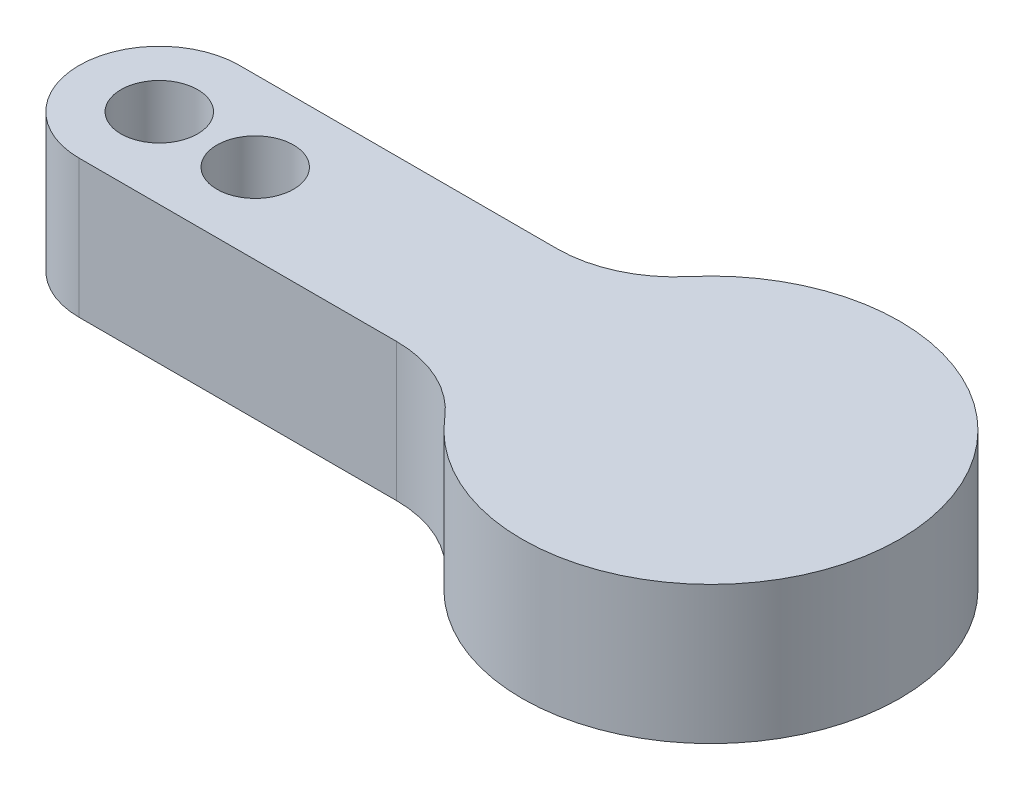
ISO-10303-21;
HEADER;
FILE_DESCRIPTION(('STEP AP214'),'2;1');
FILE_NAME('part.step','',(''),(''),'','','');
FILE_SCHEMA(('AUTOMOTIVE_DESIGN { 1 0 10303 214 1 1 1 1 }'));
ENDSEC;
DATA;
#1=APPLICATION_CONTEXT('core data for automotive mechanical design processes');
#2=APPLICATION_PROTOCOL_DEFINITION('international standard','automotive_design',2000,#1);
#3=PRODUCT_CONTEXT('',#1,'mechanical');
#4=PRODUCT('Part','Part','',(#3));
#5=PRODUCT_RELATED_PRODUCT_CATEGORY('part','',(#4));
#6=PRODUCT_DEFINITION_FORMATION('','',#4);
#7=PRODUCT_DEFINITION_CONTEXT('part definition',#1,'design');
#8=PRODUCT_DEFINITION('design','',#6,#7);
#9=PRODUCT_DEFINITION_SHAPE('','',#8);
#10=(LENGTH_UNIT() NAMED_UNIT(*) SI_UNIT(.MILLI.,.METRE.));
#11=(NAMED_UNIT(*) PLANE_ANGLE_UNIT() SI_UNIT($,.RADIAN.));
#12=(NAMED_UNIT(*) SI_UNIT($,.STERADIAN.) SOLID_ANGLE_UNIT());
#13=UNCERTAINTY_MEASURE_WITH_UNIT(LENGTH_MEASURE(1.E-05),#10,'distance_accuracy_value','');
#14=(GEOMETRIC_REPRESENTATION_CONTEXT(3) GLOBAL_UNCERTAINTY_ASSIGNED_CONTEXT((#13)) GLOBAL_UNIT_ASSIGNED_CONTEXT((#10,
#11,#12)) REPRESENTATION_CONTEXT('',''));
#15=CARTESIAN_POINT('',(0.,0.,0.));
#16=DIRECTION('',(0.,0.,1.));
#17=DIRECTION('',(1.,0.,0.));
#18=AXIS2_PLACEMENT_3D('',#15,#16,#17);
#19=CARTESIAN_POINT('',(-9.92169340384997,5.842,-8.4));
#20=DIRECTION('',(0.,-1.,0.));
#21=DIRECTION('',(0.,0.,-1.));
#22=AXIS2_PLACEMENT_3D('',#19,#20,#21);
#23=CYLINDRICAL_SURFACE('',#22,5.);
#24=CARTESIAN_POINT('',(-9.92169340384997,0.,-8.4));
#25=DIRECTION('',(0.,1.,0.));
#26=DIRECTION('',(0.,0.,1.));
#27=AXIS2_PLACEMENT_3D('',#24,#25,#26);
#28=CIRCLE('',#27,5.);
#29=CARTESIAN_POINT('',(-9.92169340384997,0.,-3.4));
#30=VERTEX_POINT('',#29);
#31=CARTESIAN_POINT('',(-6.10565747929229,0.,-5.16923076923077));
#32=VERTEX_POINT('',#31);
#33=EDGE_CURVE('E127',#30,#32,#28,.T.);
#34=ORIENTED_EDGE('',*,*,#33,.F.);
#35=DIRECTION('',(0.,-1.,0.));
#36=VECTOR('',#35,1.);
#37=CARTESIAN_POINT('',(-9.92169340384997,5.842,-3.4));
#38=LINE('',#37,#36);
#39=CARTESIAN_POINT('',(-9.92169340384997,5.842,-3.4));
#40=VERTEX_POINT('',#39);
#41=EDGE_CURVE('E11',#40,#30,#38,.T.);
#42=ORIENTED_EDGE('',*,*,#41,.F.);
#43=CARTESIAN_POINT('',(-9.92169340384997,5.842,-8.4));
#44=DIRECTION('',(0.,1.,0.));
#45=DIRECTION('',(0.,0.,1.));
#46=AXIS2_PLACEMENT_3D('',#43,#44,#45);
#47=CIRCLE('',#46,5.);
#48=CARTESIAN_POINT('',(-6.10565747929229,5.842,-5.16923076923077));
#49=VERTEX_POINT('',#48);
#50=EDGE_CURVE('E145',#40,#49,#47,.T.);
#51=ORIENTED_EDGE('',*,*,#50,.T.);
#52=DIRECTION('',(0.,-1.,0.));
#53=VECTOR('',#52,1.);
#54=CARTESIAN_POINT('',(-6.10565747929229,5.842,-5.16923076923077));
#55=LINE('',#54,#53);
#56=EDGE_CURVE('E84',#49,#32,#55,.T.);
#57=ORIENTED_EDGE('',*,*,#56,.T.);
#58=EDGE_LOOP('',(#34,#42,#51,#57));
#59=FACE_BOUND('',#58,.T.);
#60=ADVANCED_FACE('F39',(#59),#23,.F.);
#61=CARTESIAN_POINT('',(0.,5.842,-3.4));
#62=DIRECTION('',(0.,0.,-1.));
#63=DIRECTION('',(-1.,0.,0.));
#64=AXIS2_PLACEMENT_3D('',#61,#62,#63);
#65=PLANE('',#64);
#66=DIRECTION('',(1.,0.,0.));
#67=VECTOR('',#66,1.);
#68=CARTESIAN_POINT('',(0.,0.,-3.4));
#69=LINE('',#68,#67);
#70=CARTESIAN_POINT('',(-23.368,0.,-3.4));
#71=VERTEX_POINT('',#70);
#72=EDGE_CURVE('E130',#71,#30,#69,.T.);
#73=ORIENTED_EDGE('',*,*,#72,.F.);
#74=DIRECTION('',(0.,-1.,0.));
#75=VECTOR('',#74,1.);
#76=CARTESIAN_POINT('',(-23.368,5.842,-3.4));
#77=LINE('',#76,#75);
#78=CARTESIAN_POINT('',(-23.368,5.842,-3.4));
#79=VERTEX_POINT('',#78);
#80=EDGE_CURVE('E47',#79,#71,#77,.T.);
#81=ORIENTED_EDGE('',*,*,#80,.F.);
#82=DIRECTION('',(1.,0.,0.));
#83=VECTOR('',#82,1.);
#84=CARTESIAN_POINT('',(0.,5.842,-3.4));
#85=LINE('',#84,#83);
#86=EDGE_CURVE('E158',#79,#40,#85,.T.);
#87=ORIENTED_EDGE('',*,*,#86,.T.);
#88=ORIENTED_EDGE('',*,*,#41,.T.);
#89=EDGE_LOOP('',(#73,#81,#87,#88));
#90=FACE_BOUND('',#89,.T.);
#91=ADVANCED_FACE('F157',(#90),#65,.T.);
#92=CARTESIAN_POINT('',(-23.368,5.842,0.));
#93=DIRECTION('',(0.,-1.,0.));
#94=DIRECTION('',(0.,0.,-1.));
#95=AXIS2_PLACEMENT_3D('',#92,#93,#94);
#96=CYLINDRICAL_SURFACE('',#95,3.4);
#97=CARTESIAN_POINT('',(-23.368,0.,0.));
#98=DIRECTION('',(0.,1.,0.));
#99=DIRECTION('',(0.,0.,1.));
#100=AXIS2_PLACEMENT_3D('',#97,#98,#99);
#101=CIRCLE('',#100,3.4);
#102=CARTESIAN_POINT('',(-23.368,0.,3.4));
#103=VERTEX_POINT('',#102);
#104=EDGE_CURVE('E133',#71,#103,#101,.T.);
#105=ORIENTED_EDGE('',*,*,#104,.T.);
#106=DIRECTION('',(0.,-1.,0.));
#107=VECTOR('',#106,1.);
#108=CARTESIAN_POINT('',(-23.368,5.842,3.4));
#109=LINE('',#108,#107);
#110=CARTESIAN_POINT('',(-23.368,5.842,3.4));
#111=VERTEX_POINT('',#110);
#112=EDGE_CURVE('E113',#111,#103,#109,.T.);
#113=ORIENTED_EDGE('',*,*,#112,.F.);
#114=CARTESIAN_POINT('',(-23.368,5.842,0.));
#115=DIRECTION('',(0.,1.,0.));
#116=DIRECTION('',(0.,0.,1.));
#117=AXIS2_PLACEMENT_3D('',#114,#115,#116);
#118=CIRCLE('',#117,3.4);
#119=EDGE_CURVE('E104',#79,#111,#118,.T.);
#120=ORIENTED_EDGE('',*,*,#119,.F.);
#121=ORIENTED_EDGE('',*,*,#80,.T.);
#122=EDGE_LOOP('',(#105,#113,#120,#121));
#123=FACE_BOUND('',#122,.T.);
#124=ADVANCED_FACE('F150',(#123),#96,.T.);
#125=CARTESIAN_POINT('',(0.,5.842,3.4));
#126=DIRECTION('',(0.,0.,-1.));
#127=DIRECTION('',(-1.,0.,0.));
#128=AXIS2_PLACEMENT_3D('',#125,#126,#127);
#129=PLANE('',#128);
#130=DIRECTION('',(1.,0.,0.));
#131=VECTOR('',#130,1.);
#132=CARTESIAN_POINT('',(0.,0.,3.4));
#133=LINE('',#132,#131);
#134=CARTESIAN_POINT('',(-9.92169340384997,0.,3.4));
#135=VERTEX_POINT('',#134);
#136=EDGE_CURVE('E112',#103,#135,#133,.T.);
#137=ORIENTED_EDGE('',*,*,#136,.T.);
#138=DIRECTION('',(0.,-1.,0.));
#139=VECTOR('',#138,1.);
#140=CARTESIAN_POINT('',(-9.92169340384997,5.842,3.4));
#141=LINE('',#140,#139);
#142=CARTESIAN_POINT('',(-9.92169340384997,5.842,3.4));
#143=VERTEX_POINT('',#142);
#144=EDGE_CURVE('E109',#143,#135,#141,.T.);
#145=ORIENTED_EDGE('',*,*,#144,.F.);
#146=DIRECTION('',(1.,0.,0.));
#147=VECTOR('',#146,1.);
#148=CARTESIAN_POINT('',(0.,5.842,3.4));
#149=LINE('',#148,#147);
#150=EDGE_CURVE('E96',#111,#143,#149,.T.);
#151=ORIENTED_EDGE('',*,*,#150,.F.);
#152=ORIENTED_EDGE('',*,*,#112,.T.);
#153=EDGE_LOOP('',(#137,#145,#151,#152));
#154=FACE_BOUND('',#153,.T.);
#155=ADVANCED_FACE('F110',(#154),#129,.F.);
#156=CARTESIAN_POINT('',(-9.92169340384997,5.842,8.4));
#157=DIRECTION('',(0.,-1.,0.));
#158=DIRECTION('',(0.,0.,-1.));
#159=AXIS2_PLACEMENT_3D('',#156,#157,#158);
#160=CYLINDRICAL_SURFACE('',#159,5.);
#161=CARTESIAN_POINT('',(-9.92169340384997,0.,8.4));
#162=DIRECTION('',(0.,1.,0.));
#163=DIRECTION('',(0.,0.,1.));
#164=AXIS2_PLACEMENT_3D('',#161,#162,#163);
#165=CIRCLE('',#164,5.);
#166=CARTESIAN_POINT('',(-6.10565747929229,0.,5.16923076923077));
#167=VERTEX_POINT('',#166);
#168=EDGE_CURVE('E77',#135,#167,#165,.F.);
#169=ORIENTED_EDGE('',*,*,#168,.T.);
#170=DIRECTION('',(0.,-1.,0.));
#171=VECTOR('',#170,1.);
#172=CARTESIAN_POINT('',(-6.10565747929229,5.842,5.16923076923077));
#173=LINE('',#172,#171);
#174=CARTESIAN_POINT('',(-6.10565747929229,5.842,5.16923076923077));
#175=VERTEX_POINT('',#174);
#176=EDGE_CURVE('E114',#175,#167,#173,.T.);
#177=ORIENTED_EDGE('',*,*,#176,.F.);
#178=CARTESIAN_POINT('',(-9.92169340384997,5.842,8.4));
#179=DIRECTION('',(0.,1.,0.));
#180=DIRECTION('',(0.,0.,1.));
#181=AXIS2_PLACEMENT_3D('',#178,#179,#180);
#182=CIRCLE('',#181,5.);
#183=EDGE_CURVE('E101',#143,#175,#182,.F.);
#184=ORIENTED_EDGE('',*,*,#183,.F.);
#185=ORIENTED_EDGE('',*,*,#144,.T.);
#186=EDGE_LOOP('',(#169,#177,#184,#185));
#187=FACE_BOUND('',#186,.T.);
#188=ADVANCED_FACE('F116',(#187),#160,.F.);
#189=CARTESIAN_POINT('',(-23.368,5.842,0.));
#190=DIRECTION('',(0.,-1.,0.));
#191=DIRECTION('',(0.,0.,-1.));
#192=AXIS2_PLACEMENT_3D('',#189,#190,#191);
#193=CYLINDRICAL_SURFACE('',#192,1.625);
#194=CARTESIAN_POINT('',(-23.368,5.842,0.));
#195=DIRECTION('',(0.,1.,0.));
#196=DIRECTION('',(0.,0.,1.));
#197=AXIS2_PLACEMENT_3D('',#194,#195,#196);
#198=CIRCLE('',#197,1.625);
#199=CARTESIAN_POINT('',(-23.368,5.842,1.625));
#200=VERTEX_POINT('',#199);
#201=EDGE_CURVE('E118',#200,#200,#198,.T.);
#202=ORIENTED_EDGE('',*,*,#201,.T.);
#203=EDGE_LOOP('',(#202));
#204=FACE_BOUND('',#203,.T.);
#205=CARTESIAN_POINT('',(-23.368,0.,0.));
#206=DIRECTION('',(0.,1.,0.));
#207=DIRECTION('',(0.,0.,1.));
#208=AXIS2_PLACEMENT_3D('',#205,#206,#207);
#209=CIRCLE('',#208,1.625);
#210=CARTESIAN_POINT('',(-23.368,0.,1.625));
#211=VERTEX_POINT('',#210);
#212=EDGE_CURVE('E139',#211,#211,#209,.T.);
#213=ORIENTED_EDGE('',*,*,#212,.F.);
#214=EDGE_LOOP('',(#213));
#215=FACE_BOUND('',#214,.T.);
#216=ADVANCED_FACE('F166',(#204,#215),#193,.F.);
#217=CARTESIAN_POINT('',(0.,5.842,0.));
#218=DIRECTION('',(0.,-1.,0.));
#219=DIRECTION('',(0.,0.,-1.));
#220=AXIS2_PLACEMENT_3D('',#217,#218,#219);
#221=CYLINDRICAL_SURFACE('',#220,8.);
#222=CARTESIAN_POINT('',(0.,0.,0.));
#223=DIRECTION('',(0.,1.,0.));
#224=DIRECTION('',(0.,0.,1.));
#225=AXIS2_PLACEMENT_3D('',#222,#223,#224);
#226=CIRCLE('',#225,8.);
#227=EDGE_CURVE('E137',#167,#32,#226,.T.);
#228=ORIENTED_EDGE('',*,*,#227,.T.);
#229=ORIENTED_EDGE('',*,*,#56,.F.);
#230=CARTESIAN_POINT('',(0.,5.842,0.));
#231=DIRECTION('',(0.,1.,0.));
#232=DIRECTION('',(0.,0.,1.));
#233=AXIS2_PLACEMENT_3D('',#230,#231,#232);
#234=CIRCLE('',#233,8.);
#235=EDGE_CURVE('E55',#175,#49,#234,.T.);
#236=ORIENTED_EDGE('',*,*,#235,.F.);
#237=ORIENTED_EDGE('',*,*,#176,.T.);
#238=EDGE_LOOP('',(#228,#229,#236,#237));
#239=FACE_BOUND('',#238,.T.);
#240=ADVANCED_FACE('F161',(#239),#221,.T.);
#241=CARTESIAN_POINT('',(-19.304,5.842,0.));
#242=DIRECTION('',(0.,-1.,0.));
#243=DIRECTION('',(0.,0.,-1.));
#244=AXIS2_PLACEMENT_3D('',#241,#242,#243);
#245=CYLINDRICAL_SURFACE('',#244,1.625);
#246=CARTESIAN_POINT('',(-19.304,5.842,0.));
#247=DIRECTION('',(0.,1.,0.));
#248=DIRECTION('',(0.,0.,1.));
#249=AXIS2_PLACEMENT_3D('',#246,#247,#248);
#250=CIRCLE('',#249,1.625);
#251=CARTESIAN_POINT('',(-19.304,5.842,1.625));
#252=VERTEX_POINT('',#251);
#253=EDGE_CURVE('E124',#252,#252,#250,.T.);
#254=ORIENTED_EDGE('',*,*,#253,.T.);
#255=EDGE_LOOP('',(#254));
#256=FACE_BOUND('',#255,.T.);
#257=CARTESIAN_POINT('',(-19.304,0.,0.));
#258=DIRECTION('',(0.,1.,0.));
#259=DIRECTION('',(0.,0.,1.));
#260=AXIS2_PLACEMENT_3D('',#257,#258,#259);
#261=CIRCLE('',#260,1.625);
#262=CARTESIAN_POINT('',(-19.304,0.,1.625));
#263=VERTEX_POINT('',#262);
#264=EDGE_CURVE('E142',#263,#263,#261,.T.);
#265=ORIENTED_EDGE('',*,*,#264,.F.);
#266=EDGE_LOOP('',(#265));
#267=FACE_BOUND('',#266,.T.);
#268=ADVANCED_FACE('F165',(#256,#267),#245,.F.);
#269=CARTESIAN_POINT('',(0.,5.842,0.));
#270=DIRECTION('',(0.,1.,0.));
#271=DIRECTION('',(0.,0.,1.));
#272=AXIS2_PLACEMENT_3D('',#269,#270,#271);
#273=PLANE('',#272);
#274=ORIENTED_EDGE('',*,*,#50,.F.);
#275=ORIENTED_EDGE('',*,*,#86,.F.);
#276=ORIENTED_EDGE('',*,*,#119,.T.);
#277=ORIENTED_EDGE('',*,*,#150,.T.);
#278=ORIENTED_EDGE('',*,*,#183,.T.);
#279=ORIENTED_EDGE('',*,*,#235,.T.);
#280=EDGE_LOOP('',(#274,#275,#276,#277,#278,#279));
#281=FACE_BOUND('',#280,.T.);
#282=ORIENTED_EDGE('',*,*,#201,.F.);
#283=EDGE_LOOP('',(#282));
#284=FACE_BOUND('',#283,.T.);
#285=ORIENTED_EDGE('',*,*,#253,.F.);
#286=EDGE_LOOP('',(#285));
#287=FACE_BOUND('',#286,.T.);
#288=ADVANCED_FACE('F98',(#281,#284,#287),#273,.T.);
#289=CARTESIAN_POINT('',(0.,0.,0.));
#290=DIRECTION('',(0.,1.,0.));
#291=DIRECTION('',(0.,0.,1.));
#292=AXIS2_PLACEMENT_3D('',#289,#290,#291);
#293=PLANE('',#292);
#294=ORIENTED_EDGE('',*,*,#33,.T.);
#295=ORIENTED_EDGE('',*,*,#227,.F.);
#296=ORIENTED_EDGE('',*,*,#168,.F.);
#297=ORIENTED_EDGE('',*,*,#136,.F.);
#298=ORIENTED_EDGE('',*,*,#104,.F.);
#299=ORIENTED_EDGE('',*,*,#72,.T.);
#300=EDGE_LOOP('',(#294,#295,#296,#297,#298,#299));
#301=FACE_BOUND('',#300,.T.);
#302=ORIENTED_EDGE('',*,*,#212,.T.);
#303=EDGE_LOOP('',(#302));
#304=FACE_BOUND('',#303,.T.);
#305=ORIENTED_EDGE('',*,*,#264,.T.);
#306=EDGE_LOOP('',(#305));
#307=FACE_BOUND('',#306,.T.);
#308=ADVANCED_FACE('F155',(#301,#304,#307),#293,.F.);
#309=CLOSED_SHELL('',(#60,#91,#124,#155,#188,#216,#240,#268,#288,#308));
#310=MANIFOLD_SOLID_BREP('B2',#309);
#311=ADVANCED_BREP_SHAPE_REPRESENTATION('',(#18,#310),#14);
#312=SHAPE_DEFINITION_REPRESENTATION(#9,#311);
ENDSEC;
END-ISO-10303-21;
